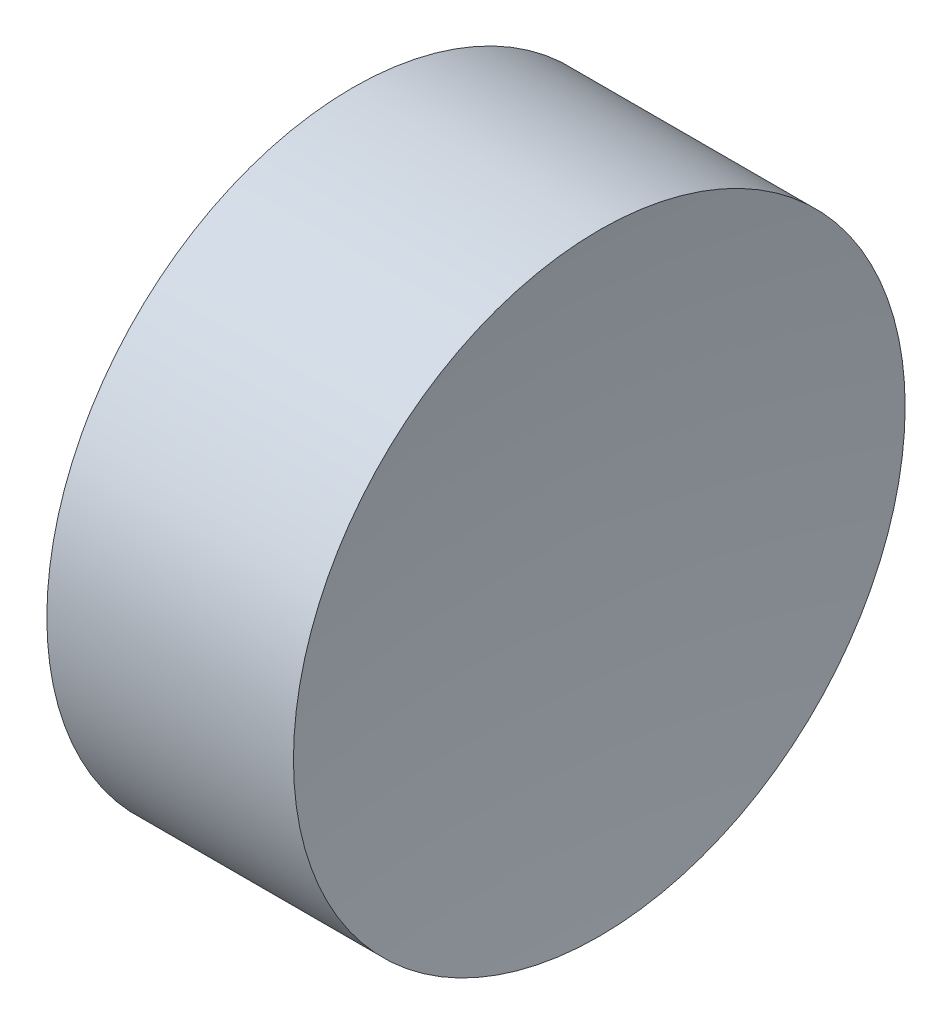
ISO-10303-21;
HEADER;
FILE_DESCRIPTION(('STEP AP214'),'2;1');
FILE_NAME('part.step','',(''),(''),'','','');
FILE_SCHEMA(('AUTOMOTIVE_DESIGN { 1 0 10303 214 1 1 1 1 }'));
ENDSEC;
DATA;
#1=APPLICATION_CONTEXT('core data for automotive mechanical design processes');
#2=APPLICATION_PROTOCOL_DEFINITION('international standard','automotive_design',2000,#1);
#3=PRODUCT_CONTEXT('',#1,'mechanical');
#4=PRODUCT('Part','Part','',(#3));
#5=PRODUCT_RELATED_PRODUCT_CATEGORY('part','',(#4));
#6=PRODUCT_DEFINITION_FORMATION('','',#4);
#7=PRODUCT_DEFINITION_CONTEXT('part definition',#1,'design');
#8=PRODUCT_DEFINITION('design','',#6,#7);
#9=PRODUCT_DEFINITION_SHAPE('','',#8);
#10=(LENGTH_UNIT() NAMED_UNIT(*) SI_UNIT(.MILLI.,.METRE.));
#11=(NAMED_UNIT(*) PLANE_ANGLE_UNIT() SI_UNIT($,.RADIAN.));
#12=(NAMED_UNIT(*) SI_UNIT($,.STERADIAN.) SOLID_ANGLE_UNIT());
#13=UNCERTAINTY_MEASURE_WITH_UNIT(LENGTH_MEASURE(1.E-05),#10,'distance_accuracy_value','');
#14=(GEOMETRIC_REPRESENTATION_CONTEXT(3) GLOBAL_UNCERTAINTY_ASSIGNED_CONTEXT((#13)) GLOBAL_UNIT_ASSIGNED_CONTEXT((#10,
#11,#12)) REPRESENTATION_CONTEXT('',''));
#15=CARTESIAN_POINT('',(0.,0.,0.));
#16=DIRECTION('',(0.,0.,1.));
#17=DIRECTION('',(1.,0.,0.));
#18=AXIS2_PLACEMENT_3D('',#15,#16,#17);
#19=CARTESIAN_POINT('',(23.0140372889399,6.52226028729874,0.041323141543835));
#20=DIRECTION('',(0.,-1.,0.));
#21=DIRECTION('',(0.,0.,1.));
#22=AXIS2_PLACEMENT_3D('',#19,#20,#21);
#23=CIRCLE('',#22,10.5);
#24=TRIMMED_CURVE('',#23,(PARAMETER_VALUE(-1.57473187424409)),
(PARAMETER_VALUE(1.57473187424409)),.T.,.PARAMETER.);
#25=CARTESIAN_POINT('',(23.0140372889399,6.52226028729874,0.));
#26=DIRECTION('',(-1.,0.,0.));
#27=AXIS1_PLACEMENT('',#25,#26);
#28=SURFACE_OF_REVOLUTION('',#24,#27);
#29=CARTESIAN_POINT('',(12.6158517826795,6.52226028729874,0.));
#30=DIRECTION('',(-1.,0.,0.));
#31=DIRECTION('',(0.,0.,1.));
#32=AXIS2_PLACEMENT_3D('',#29,#30,#31);
#33=CIRCLE('',#32,1.5);
#34=CARTESIAN_POINT('',(12.6158517826795,6.52226028729874,1.5));
#35=VERTEX_POINT('',#34);
#36=EDGE_CURVE('E11',#35,#35,#33,.T.);
#37=ORIENTED_EDGE('',*,*,#36,.F.);
#38=EDGE_LOOP('',(#37));
#39=FACE_BOUND('',#38,.T.);
#40=CARTESIAN_POINT('',(12.514118603637,6.52226028729874,0.));
#41=VERTEX_POINT('',#40);
#42=VERTEX_LOOP('',#41);
#43=FACE_BOUND('',#42,.T.);
#44=ADVANCED_FACE('F37',(#39,#43),#28,.F.);
#45=CARTESIAN_POINT('',(10.6124652785342,6.52226028729874,0.));
#46=DIRECTION('',(-1.,0.,0.));
#47=DIRECTION('',(0.,0.,1.));
#48=AXIS2_PLACEMENT_3D('',#45,#46,#47);
#49=CYLINDRICAL_SURFACE('',#48,1.5);
#50=CARTESIAN_POINT('',(11.4064234490503,6.52226028729874,0.));
#51=DIRECTION('',(-1.,0.,0.));
#52=DIRECTION('',(0.,0.,1.));
#53=AXIS2_PLACEMENT_3D('',#50,#51,#52);
#54=CIRCLE('',#53,1.5);
#55=CARTESIAN_POINT('',(11.4064234490503,6.52226028729874,1.5));
#56=VERTEX_POINT('',#55);
#57=EDGE_CURVE('E43',#56,#56,#54,.T.);
#58=ORIENTED_EDGE('',*,*,#57,.F.);
#59=EDGE_LOOP('',(#58));
#60=FACE_BOUND('',#59,.T.);
#61=ORIENTED_EDGE('',*,*,#36,.T.);
#62=EDGE_LOOP('',(#61));
#63=FACE_BOUND('',#62,.T.);
#64=ADVANCED_FACE('F47',(#60,#63),#49,.T.);
#65=CARTESIAN_POINT('',(1.01411860363702,6.52226028729874,0.));
#66=DIRECTION('',(-1.,0.,0.));
#67=DIRECTION('',(0.,1.,0.));
#68=AXIS2_PLACEMENT_3D('',#65,#66,#67);
#69=SPHERICAL_SURFACE('',#68,10.5);
#70=ORIENTED_EDGE('',*,*,#57,.T.);
#71=EDGE_LOOP('',(#70));
#72=FACE_BOUND('',#71,.T.);
#73=ADVANCED_FACE('F52',(#72),#69,.F.);
#74=CLOSED_SHELL('',(#44,#64,#73));
#75=MANIFOLD_SOLID_BREP('B2',#74);
#76=ADVANCED_BREP_SHAPE_REPRESENTATION('',(#18,#75),#14);
#77=SHAPE_DEFINITION_REPRESENTATION(#9,#76);
ENDSEC;
END-ISO-10303-21;
